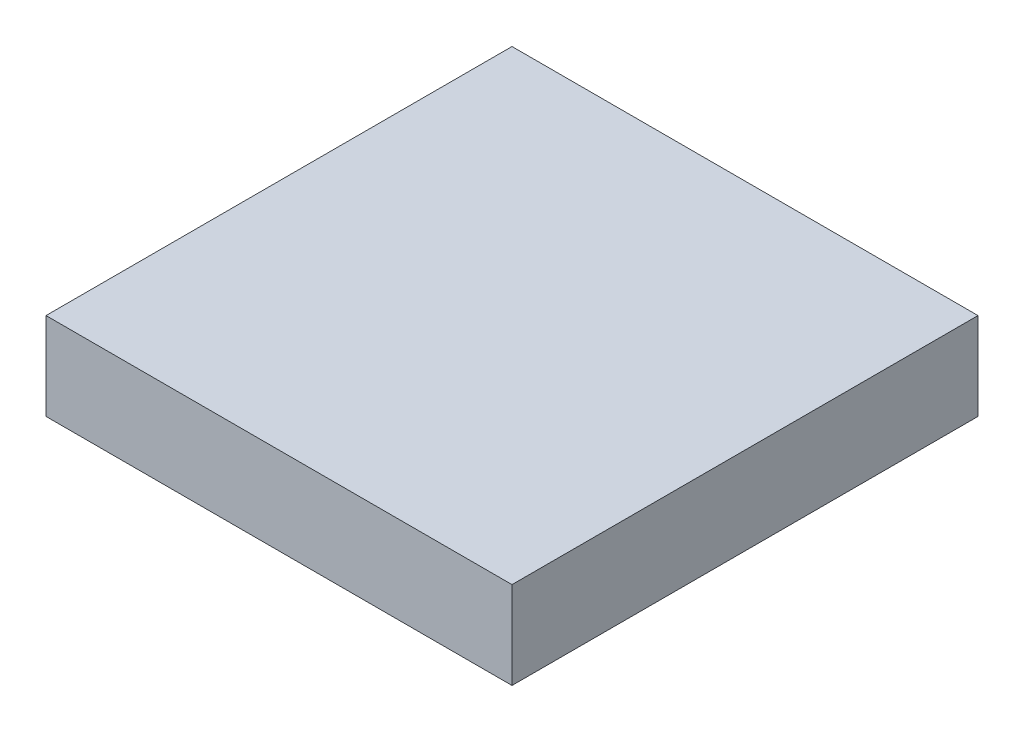
ISO-10303-21;
HEADER;
FILE_DESCRIPTION(('STEP AP214'),'2;1');
FILE_NAME('part.step','',(''),(''),'','','');
FILE_SCHEMA(('AUTOMOTIVE_DESIGN { 1 0 10303 214 1 1 1 1 }'));
ENDSEC;
DATA;
#1=APPLICATION_CONTEXT('core data for automotive mechanical design processes');
#2=APPLICATION_PROTOCOL_DEFINITION('international standard','automotive_design',2000,#1);
#3=PRODUCT_CONTEXT('',#1,'mechanical');
#4=PRODUCT('Part','Part','',(#3));
#5=PRODUCT_RELATED_PRODUCT_CATEGORY('part','',(#4));
#6=PRODUCT_DEFINITION_FORMATION('','',#4);
#7=PRODUCT_DEFINITION_CONTEXT('part definition',#1,'design');
#8=PRODUCT_DEFINITION('design','',#6,#7);
#9=PRODUCT_DEFINITION_SHAPE('','',#8);
#10=(LENGTH_UNIT() NAMED_UNIT(*) SI_UNIT(.MILLI.,.METRE.));
#11=(NAMED_UNIT(*) PLANE_ANGLE_UNIT() SI_UNIT($,.RADIAN.));
#12=(NAMED_UNIT(*) SI_UNIT($,.STERADIAN.) SOLID_ANGLE_UNIT());
#13=UNCERTAINTY_MEASURE_WITH_UNIT(LENGTH_MEASURE(1.E-05),#10,'distance_accuracy_value','');
#14=(GEOMETRIC_REPRESENTATION_CONTEXT(3) GLOBAL_UNCERTAINTY_ASSIGNED_CONTEXT((#13)) GLOBAL_UNIT_ASSIGNED_CONTEXT((#10,
#11,#12)) REPRESENTATION_CONTEXT('',''));
#15=CARTESIAN_POINT('',(0.,0.,0.));
#16=DIRECTION('',(0.,0.,1.));
#17=DIRECTION('',(1.,0.,0.));
#18=AXIS2_PLACEMENT_3D('',#15,#16,#17);
#19=CARTESIAN_POINT('',(101.6,19.05,203.2));
#20=DIRECTION('',(-1.,0.,0.));
#21=DIRECTION('',(0.,0.,1.));
#22=AXIS2_PLACEMENT_3D('',#19,#20,#21);
#23=PLANE('',#22);
#24=DIRECTION('',(0.,1.,0.));
#25=VECTOR('',#24,1.);
#26=CARTESIAN_POINT('',(101.6,19.05,0.));
#27=LINE('',#26,#25);
#28=CARTESIAN_POINT('',(101.6,-19.05,0.));
#29=VERTEX_POINT('',#28);
#30=CARTESIAN_POINT('',(101.6,19.05,0.));
#31=VERTEX_POINT('',#30);
#32=EDGE_CURVE('E104',#29,#31,#27,.T.);
#33=ORIENTED_EDGE('',*,*,#32,.T.);
#34=DIRECTION('',(0.,0.,-1.));
#35=VECTOR('',#34,1.);
#36=CARTESIAN_POINT('',(101.6,19.05,203.2));
#37=LINE('',#36,#35);
#38=CARTESIAN_POINT('',(101.6,19.05,203.2));
#39=VERTEX_POINT('',#38);
#40=EDGE_CURVE('E11',#39,#31,#37,.T.);
#41=ORIENTED_EDGE('',*,*,#40,.F.);
#42=DIRECTION('',(0.,1.,0.));
#43=VECTOR('',#42,1.);
#44=CARTESIAN_POINT('',(101.6,19.05,203.2));
#45=LINE('',#44,#43);
#46=CARTESIAN_POINT('',(101.6,-19.05,203.2));
#47=VERTEX_POINT('',#46);
#48=EDGE_CURVE('E92',#47,#39,#45,.T.);
#49=ORIENTED_EDGE('',*,*,#48,.F.);
#50=DIRECTION('',(0.,0.,-1.));
#51=VECTOR('',#50,1.);
#52=CARTESIAN_POINT('',(101.6,-19.05,203.2));
#53=LINE('',#52,#51);
#54=EDGE_CURVE('E100',#47,#29,#53,.T.);
#55=ORIENTED_EDGE('',*,*,#54,.T.);
#56=EDGE_LOOP('',(#33,#41,#49,#55));
#57=FACE_BOUND('',#56,.T.);
#58=ADVANCED_FACE('F41',(#57),#23,.F.);
#59=CARTESIAN_POINT('',(-101.6,19.05,203.2));
#60=DIRECTION('',(0.,-1.,0.));
#61=DIRECTION('',(0.,0.,-1.));
#62=AXIS2_PLACEMENT_3D('',#59,#60,#61);
#63=PLANE('',#62);
#64=DIRECTION('',(-1.,0.,0.));
#65=VECTOR('',#64,1.);
#66=CARTESIAN_POINT('',(-101.6,19.05,0.));
#67=LINE('',#66,#65);
#68=CARTESIAN_POINT('',(-101.6,19.05,0.));
#69=VERTEX_POINT('',#68);
#70=EDGE_CURVE('E96',#31,#69,#67,.T.);
#71=ORIENTED_EDGE('',*,*,#70,.T.);
#72=DIRECTION('',(0.,0.,-1.));
#73=VECTOR('',#72,1.);
#74=CARTESIAN_POINT('',(-101.6,19.05,203.2));
#75=LINE('',#74,#73);
#76=CARTESIAN_POINT('',(-101.6,19.05,203.2));
#77=VERTEX_POINT('',#76);
#78=EDGE_CURVE('E49',#77,#69,#75,.T.);
#79=ORIENTED_EDGE('',*,*,#78,.F.);
#80=DIRECTION('',(-1.,0.,0.));
#81=VECTOR('',#80,1.);
#82=CARTESIAN_POINT('',(-101.6,19.05,203.2));
#83=LINE('',#82,#81);
#84=EDGE_CURVE('E87',#39,#77,#83,.T.);
#85=ORIENTED_EDGE('',*,*,#84,.F.);
#86=ORIENTED_EDGE('',*,*,#40,.T.);
#87=EDGE_LOOP('',(#71,#79,#85,#86));
#88=FACE_BOUND('',#87,.T.);
#89=ADVANCED_FACE('F95',(#88),#63,.F.);
#90=CARTESIAN_POINT('',(-101.6,19.05,203.2));
#91=DIRECTION('',(1.,0.,0.));
#92=DIRECTION('',(0.,0.,-1.));
#93=AXIS2_PLACEMENT_3D('',#90,#91,#92);
#94=PLANE('',#93);
#95=DIRECTION('',(0.,-1.,0.));
#96=VECTOR('',#95,1.);
#97=CARTESIAN_POINT('',(-101.6,19.05,0.));
#98=LINE('',#97,#96);
#99=CARTESIAN_POINT('',(-101.6,-19.05,0.));
#100=VERTEX_POINT('',#99);
#101=EDGE_CURVE('E74',#69,#100,#98,.T.);
#102=ORIENTED_EDGE('',*,*,#101,.T.);
#103=DIRECTION('',(0.,0.,-1.));
#104=VECTOR('',#103,1.);
#105=CARTESIAN_POINT('',(-101.6,-19.05,203.2));
#106=LINE('',#105,#104);
#107=CARTESIAN_POINT('',(-101.6,-19.05,203.2));
#108=VERTEX_POINT('',#107);
#109=EDGE_CURVE('E97',#108,#100,#106,.T.);
#110=ORIENTED_EDGE('',*,*,#109,.F.);
#111=DIRECTION('',(0.,-1.,0.));
#112=VECTOR('',#111,1.);
#113=CARTESIAN_POINT('',(-101.6,19.05,203.2));
#114=LINE('',#113,#112);
#115=EDGE_CURVE('E90',#77,#108,#114,.T.);
#116=ORIENTED_EDGE('',*,*,#115,.F.);
#117=ORIENTED_EDGE('',*,*,#78,.T.);
#118=EDGE_LOOP('',(#102,#110,#116,#117));
#119=FACE_BOUND('',#118,.T.);
#120=ADVANCED_FACE('F98',(#119),#94,.F.);
#121=CARTESIAN_POINT('',(-101.6,-19.05,203.2));
#122=DIRECTION('',(0.,1.,0.));
#123=DIRECTION('',(0.,0.,1.));
#124=AXIS2_PLACEMENT_3D('',#121,#122,#123);
#125=PLANE('',#124);
#126=DIRECTION('',(1.,0.,0.));
#127=VECTOR('',#126,1.);
#128=CARTESIAN_POINT('',(-101.6,-19.05,0.));
#129=LINE('',#128,#127);
#130=EDGE_CURVE('E80',#100,#29,#129,.T.);
#131=ORIENTED_EDGE('',*,*,#130,.T.);
#132=ORIENTED_EDGE('',*,*,#54,.F.);
#133=DIRECTION('',(1.,0.,0.));
#134=VECTOR('',#133,1.);
#135=CARTESIAN_POINT('',(-101.6,-19.05,203.2));
#136=LINE('',#135,#134);
#137=EDGE_CURVE('E57',#108,#47,#136,.T.);
#138=ORIENTED_EDGE('',*,*,#137,.F.);
#139=ORIENTED_EDGE('',*,*,#109,.T.);
#140=EDGE_LOOP('',(#131,#132,#138,#139));
#141=FACE_BOUND('',#140,.T.);
#142=ADVANCED_FACE('F111',(#141),#125,.F.);
#143=CARTESIAN_POINT('',(0.,0.,203.2));
#144=DIRECTION('',(0.,0.,1.));
#145=DIRECTION('',(1.,0.,0.));
#146=AXIS2_PLACEMENT_3D('',#143,#144,#145);
#147=PLANE('',#146);
#148=ORIENTED_EDGE('',*,*,#48,.T.);
#149=ORIENTED_EDGE('',*,*,#84,.T.);
#150=ORIENTED_EDGE('',*,*,#115,.T.);
#151=ORIENTED_EDGE('',*,*,#137,.T.);
#152=EDGE_LOOP('',(#148,#149,#150,#151));
#153=FACE_BOUND('',#152,.T.);
#154=ADVANCED_FACE('F88',(#153),#147,.T.);
#155=CARTESIAN_POINT('',(0.,0.,0.));
#156=DIRECTION('',(0.,0.,1.));
#157=DIRECTION('',(1.,0.,0.));
#158=AXIS2_PLACEMENT_3D('',#155,#156,#157);
#159=PLANE('',#158);
#160=ORIENTED_EDGE('',*,*,#32,.F.);
#161=ORIENTED_EDGE('',*,*,#130,.F.);
#162=ORIENTED_EDGE('',*,*,#101,.F.);
#163=ORIENTED_EDGE('',*,*,#70,.F.);
#164=EDGE_LOOP('',(#160,#161,#162,#163));
#165=FACE_BOUND('',#164,.T.);
#166=ADVANCED_FACE('F114',(#165),#159,.F.);
#167=CLOSED_SHELL('',(#58,#89,#120,#142,#154,#166));
#168=MANIFOLD_SOLID_BREP('B2',#167);
#169=ADVANCED_BREP_SHAPE_REPRESENTATION('',(#18,#168),#14);
#170=SHAPE_DEFINITION_REPRESENTATION(#9,#169);
ENDSEC;
END-ISO-10303-21;
